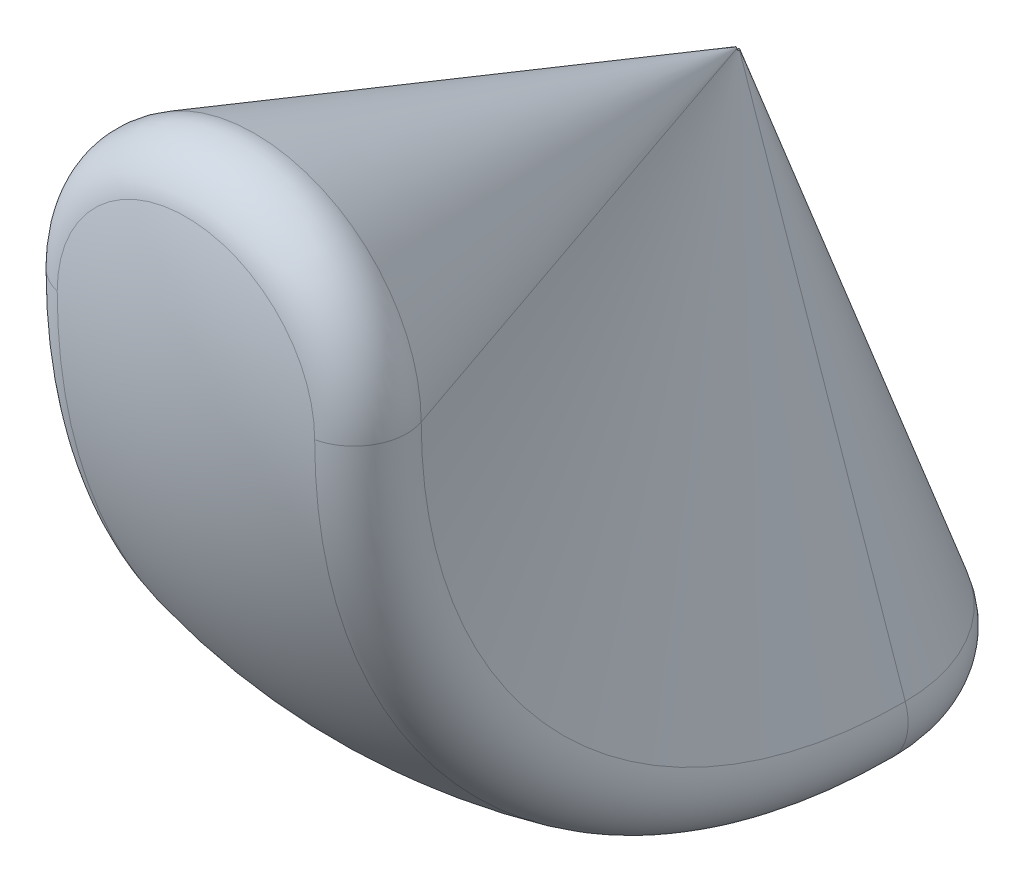
ISO-10303-21;
HEADER;
FILE_DESCRIPTION(('STEP AP214'),'2;1');
FILE_NAME('part.step','',(''),(''),'','','');
FILE_SCHEMA(('AUTOMOTIVE_DESIGN { 1 0 10303 214 1 1 1 1 }'));
ENDSEC;
DATA;
#1=APPLICATION_CONTEXT('core data for automotive mechanical design processes');
#2=APPLICATION_PROTOCOL_DEFINITION('international standard','automotive_design',2000,#1);
#3=PRODUCT_CONTEXT('',#1,'mechanical');
#4=PRODUCT('Part','Part','',(#3));
#5=PRODUCT_RELATED_PRODUCT_CATEGORY('part','',(#4));
#6=PRODUCT_DEFINITION_FORMATION('','',#4);
#7=PRODUCT_DEFINITION_CONTEXT('part definition',#1,'design');
#8=PRODUCT_DEFINITION('design','',#6,#7);
#9=PRODUCT_DEFINITION_SHAPE('','',#8);
#10=(LENGTH_UNIT() NAMED_UNIT(*) SI_UNIT(.MILLI.,.METRE.));
#11=(NAMED_UNIT(*) PLANE_ANGLE_UNIT() SI_UNIT($,.RADIAN.));
#12=(NAMED_UNIT(*) SI_UNIT($,.STERADIAN.) SOLID_ANGLE_UNIT());
#13=UNCERTAINTY_MEASURE_WITH_UNIT(LENGTH_MEASURE(1.E-05),#10,'distance_accuracy_value','');
#14=(GEOMETRIC_REPRESENTATION_CONTEXT(3) GLOBAL_UNCERTAINTY_ASSIGNED_CONTEXT((#13)) GLOBAL_UNIT_ASSIGNED_CONTEXT((#10,
#11,#12)) REPRESENTATION_CONTEXT('',''));
#15=CARTESIAN_POINT('',(0.,0.,0.));
#16=DIRECTION('',(0.,0.,1.));
#17=DIRECTION('',(1.,0.,0.));
#18=AXIS2_PLACEMENT_3D('',#15,#16,#17);
#19=CARTESIAN_POINT('',(1327.21859259555,0.,0.));
#20=DIRECTION('',(-1.,0.,0.));
#21=DIRECTION('',(0.,0.,1.));
#22=AXIS2_PLACEMENT_3D('',#19,#20,#21);
#23=TOROIDAL_SURFACE('',#22,5697.45476572379,600.000000000001);
#24=CARTESIAN_POINT('',(1463.3435764515,0.,0.));
#25=DIRECTION('',(-1.,0.,0.));
#26=DIRECTION('',(0.,0.,1.));
#27=AXIS2_PLACEMENT_3D('',#24,#25,#26);
#28=CIRCLE('',#27,6281.80910066982);
#29=CARTESIAN_POINT('',(1463.3435764515,-6281.80910066982,-2.19328319526542E-11));
#30=VERTEX_POINT('',#29);
#31=CARTESIAN_POINT('',(1463.3435764515,0.,6281.80910066982));
#32=VERTEX_POINT('',#31);
#33=EDGE_CURVE('E11',#30,#32,#28,.T.);
#34=ORIENTED_EDGE('',*,*,#33,.F.);
#35=CARTESIAN_POINT('',(1327.21859259555,-5697.45476572379,-1.98925685151979E-11));
#36=DIRECTION('',(0.,0.,1.));
#37=DIRECTION('',(0.,1.,0.));
#38=AXIS2_PLACEMENT_3D('',#35,#36,#37);
#39=CIRCLE('',#38,600.000000000001);
#40=CARTESIAN_POINT('',(1894.52973795514,-5502.11387304949,-1.92420065438025E-11));
#41=VERTEX_POINT('',#40);
#42=EDGE_CURVE('E46',#30,#41,#39,.T.);
#43=ORIENTED_EDGE('',*,*,#42,.T.);
#44=CARTESIAN_POINT('',(1894.52973795514,0.,0.));
#45=DIRECTION('',(-1.,0.,0.));
#46=DIRECTION('',(0.,0.,1.));
#47=AXIS2_PLACEMENT_3D('',#44,#45,#46);
#48=CIRCLE('',#47,5502.11387304949);
#49=CARTESIAN_POINT('',(1894.52973795514,0.,5502.11387304949));
#50=VERTEX_POINT('',#49);
#51=EDGE_CURVE('E111',#41,#50,#48,.T.);
#52=ORIENTED_EDGE('',*,*,#51,.T.);
#53=CARTESIAN_POINT('',(1327.21859259555,0.,5697.45476572379));
#54=DIRECTION('',(0.,1.,0.));
#55=DIRECTION('',(0.,0.,-1.));
#56=AXIS2_PLACEMENT_3D('',#53,#54,#55);
#57=CIRCLE('',#56,600.000000000001);
#58=EDGE_CURVE('E137',#32,#50,#57,.T.);
#59=ORIENTED_EDGE('',*,*,#58,.F.);
#60=EDGE_LOOP('',(#34,#43,#52,#59));
#61=FACE_BOUND('',#60,.T.);
#62=ADVANCED_FACE('F31',(#61),#23,.T.);
#63=CARTESIAN_POINT('',(0.,0.,0.));
#64=DIRECTION('',(-1.,0.,0.));
#65=DIRECTION('',(0.,-1.,0.));
#66=AXIS2_PLACEMENT_3D('',#63,#64,#65);
#67=SPHERICAL_SURFACE('',#66,6450.);
#68=CARTESIAN_POINT('',(-1463.34357645141,0.,0.));
#69=DIRECTION('',(-1.,0.,0.));
#70=DIRECTION('',(0.,0.,1.));
#71=AXIS2_PLACEMENT_3D('',#68,#69,#70);
#72=CIRCLE('',#71,6281.80910066984);
#73=CARTESIAN_POINT('',(-1463.3435764515,-6281.80910066982,-1.17502791670365E-11));
#74=VERTEX_POINT('',#73);
#75=CARTESIAN_POINT('',(-1463.34357645141,0.,6281.80910066984));
#76=VERTEX_POINT('',#75);
#77=EDGE_CURVE('E39',#74,#76,#72,.T.);
#78=ORIENTED_EDGE('',*,*,#77,.F.);
#79=CARTESIAN_POINT('',(0.,-6281.80910066982,-2.196875866457E-11));
#80=DIRECTION('',(0.,-1.,0.));
#81=DIRECTION('',(0.,0.,-1.));
#82=AXIS2_PLACEMENT_3D('',#79,#80,#81);
#83=CIRCLE('',#82,1463.3435764515);
#84=EDGE_CURVE('E100',#74,#30,#83,.T.);
#85=ORIENTED_EDGE('',*,*,#84,.T.);
#86=ORIENTED_EDGE('',*,*,#33,.T.);
#87=CARTESIAN_POINT('',(7.65242599136855E-13,-3.48710454993175E-13,6281.80910066984));
#88=DIRECTION('',(0.,0.,1.));
#89=DIRECTION('',(1.,0.,0.));
#90=AXIS2_PLACEMENT_3D('',#87,#88,#89);
#91=CIRCLE('',#90,1463.34357645141);
#92=EDGE_CURVE('E134',#32,#76,#91,.T.);
#93=ORIENTED_EDGE('',*,*,#92,.T.);
#94=EDGE_LOOP('',(#78,#85,#86,#93));
#95=FACE_BOUND('',#94,.T.);
#96=ADVANCED_FACE('F33',(#95),#67,.T.);
#97=CARTESIAN_POINT('',(-1327.21859259546,0.,0.));
#98=DIRECTION('',(-1.,0.,0.));
#99=DIRECTION('',(0.,0.,1.));
#100=AXIS2_PLACEMENT_3D('',#97,#98,#99);
#101=TOROIDAL_SURFACE('',#100,5697.45476572381,600.);
#102=CARTESIAN_POINT('',(-1894.52973795506,0.,0.));
#103=DIRECTION('',(-1.,0.,0.));
#104=DIRECTION('',(0.,0.,1.));
#105=AXIS2_PLACEMENT_3D('',#102,#103,#104);
#106=CIRCLE('',#105,5502.11387304952);
#107=CARTESIAN_POINT('',(-1894.52973795514,-5502.11387304949,-6.01256842940791E-12));
#108=VERTEX_POINT('',#107);
#109=CARTESIAN_POINT('',(-1894.52973795506,-3.05428675298453E-13,5502.11387304952));
#110=VERTEX_POINT('',#109);
#111=EDGE_CURVE('E125',#108,#110,#106,.T.);
#112=ORIENTED_EDGE('',*,*,#111,.F.);
#113=CARTESIAN_POINT('',(-1327.21859259546,-5697.45476572381,-1.9892568515198E-11));
#114=DIRECTION('',(0.,0.,1.));
#115=DIRECTION('',(0.,-1.,0.));
#116=AXIS2_PLACEMENT_3D('',#113,#114,#115);
#117=CIRCLE('',#116,600.);
#118=EDGE_CURVE('E120',#108,#74,#117,.T.);
#119=ORIENTED_EDGE('',*,*,#118,.T.);
#120=ORIENTED_EDGE('',*,*,#77,.T.);
#121=CARTESIAN_POINT('',(-1327.21859259546,0.,5697.45476572381));
#122=DIRECTION('',(0.,1.,0.));
#123=DIRECTION('',(0.,0.,1.));
#124=AXIS2_PLACEMENT_3D('',#121,#122,#123);
#125=CIRCLE('',#124,600.);
#126=EDGE_CURVE('E115',#110,#76,#125,.T.);
#127=ORIENTED_EDGE('',*,*,#126,.F.);
#128=EDGE_LOOP('',(#112,#119,#120,#127));
#129=FACE_BOUND('',#128,.T.);
#130=ADVANCED_FACE('F130',(#129),#101,.T.);
#131=CARTESIAN_POINT('',(-10.3298283986897,0.,0.));
#132=DIRECTION('',(-1.,0.,0.));
#133=DIRECTION('',(0.,0.,1.));
#134=AXIS2_PLACEMENT_3D('',#131,#132,#133);
#135=CONICAL_SURFACE('',#134,30.,1.23918376891598);
#136=CARTESIAN_POINT('',(-10.3298283986897,0.,0.));
#137=DIRECTION('',(-1.,0.,0.));
#138=DIRECTION('',(0.,0.,1.));
#139=AXIS2_PLACEMENT_3D('',#136,#137,#138);
#140=CIRCLE('',#139,30.);
#141=CARTESIAN_POINT('',(-10.3298283986902,-30.,0.));
#142=VERTEX_POINT('',#141);
#143=CARTESIAN_POINT('',(-10.3298283986897,0.,30.));
#144=VERTEX_POINT('',#143);
#145=EDGE_CURVE('E110',#142,#144,#140,.T.);
#146=ORIENTED_EDGE('',*,*,#145,.F.);
#147=DIRECTION('',(-0.325568154457151,-0.945518575599319,0.));
#148=VECTOR('',#147,1.);
#149=CARTESIAN_POINT('',(-10.3298283986897,-30.,-1.04744500833281E-13));
#150=LINE('',#149,#148);
#151=EDGE_CURVE('E89',#142,#108,#150,.T.);
#152=ORIENTED_EDGE('',*,*,#151,.T.);
#153=ORIENTED_EDGE('',*,*,#111,.T.);
#154=DIRECTION('',(-0.325568154457151,0.,0.945518575599319));
#155=VECTOR('',#154,1.);
#156=CARTESIAN_POINT('',(-10.3298283986897,0.,30.));
#157=LINE('',#156,#155);
#158=EDGE_CURVE('E145',#144,#110,#157,.T.);
#159=ORIENTED_EDGE('',*,*,#158,.F.);
#160=EDGE_LOOP('',(#146,#152,#153,#159));
#161=FACE_BOUND('',#160,.T.);
#162=ADVANCED_FACE('F162',(#161),#135,.F.);
#163=CARTESIAN_POINT('',(-2826.40974752601,0.,0.));
#164=DIRECTION('',(-1.,0.,0.));
#165=DIRECTION('',(0.,0.,1.));
#166=AXIS2_PLACEMENT_3D('',#163,#164,#165);
#167=CYLINDRICAL_SURFACE('',#166,30.);
#168=CARTESIAN_POINT('',(10.3298283986901,0.,0.));
#169=DIRECTION('',(-1.,0.,0.));
#170=DIRECTION('',(0.,0.,1.));
#171=AXIS2_PLACEMENT_3D('',#168,#169,#170);
#172=CIRCLE('',#171,30.);
#173=CARTESIAN_POINT('',(10.3298283986902,-30.,-1.04916075827077E-13));
#174=VERTEX_POINT('',#173);
#175=CARTESIAN_POINT('',(10.3298283986902,0.,30.));
#176=VERTEX_POINT('',#175);
#177=EDGE_CURVE('E103',#174,#176,#172,.T.);
#178=ORIENTED_EDGE('',*,*,#177,.F.);
#179=DIRECTION('',(-1.,0.,0.));
#180=VECTOR('',#179,1.);
#181=CARTESIAN_POINT('',(10.3298283986902,-30.,-1.04744500833281E-13));
#182=LINE('',#181,#180);
#183=EDGE_CURVE('E82',#174,#142,#182,.T.);
#184=ORIENTED_EDGE('',*,*,#183,.T.);
#185=ORIENTED_EDGE('',*,*,#145,.T.);
#186=DIRECTION('',(-1.,0.,0.));
#187=VECTOR('',#186,1.);
#188=CARTESIAN_POINT('',(10.3298283986902,0.,30.));
#189=LINE('',#188,#187);
#190=EDGE_CURVE('E106',#176,#144,#189,.T.);
#191=ORIENTED_EDGE('',*,*,#190,.F.);
#192=EDGE_LOOP('',(#178,#184,#185,#191));
#193=FACE_BOUND('',#192,.T.);
#194=ADVANCED_FACE('F104',(#193),#167,.F.);
#195=CARTESIAN_POINT('',(1894.52973795514,0.,0.));
#196=DIRECTION('',(1.,0.,0.));
#197=DIRECTION('',(0.,0.,-1.));
#198=AXIS2_PLACEMENT_3D('',#195,#196,#197);
#199=CONICAL_SURFACE('',#198,5502.11387304949,1.23918376891597);
#200=DIRECTION('',(-0.325568154457164,0.945518575599314,0.));
#201=VECTOR('',#200,1.);
#202=CARTESIAN_POINT('',(10.3298283986902,-30.,-1.04744500833281E-13));
#203=LINE('',#202,#201);
#204=EDGE_CURVE('E90',#41,#174,#203,.T.);
#205=ORIENTED_EDGE('',*,*,#204,.T.);
#206=ORIENTED_EDGE('',*,*,#177,.T.);
#207=DIRECTION('',(-0.325568154457164,0.,-0.945518575599314));
#208=VECTOR('',#207,1.);
#209=CARTESIAN_POINT('',(10.3298283986902,0.,30.));
#210=LINE('',#209,#208);
#211=EDGE_CURVE('E149',#50,#176,#210,.T.);
#212=ORIENTED_EDGE('',*,*,#211,.F.);
#213=ORIENTED_EDGE('',*,*,#51,.F.);
#214=EDGE_LOOP('',(#205,#206,#212,#213));
#215=FACE_BOUND('',#214,.T.);
#216=ADVANCED_FACE('F113',(#215),#199,.F.);
#217=CARTESIAN_POINT('',(6.66133814775094E-13,-3.16272273133346E-13,5697.45476572381));
#218=DIRECTION('',(0.,0.,1.));
#219=DIRECTION('',(1.,0.,0.));
#220=AXIS2_PLACEMENT_3D('',#217,#218,#219);
#221=TOROIDAL_SURFACE('',#220,1327.21859259547,600.);
#222=ORIENTED_EDGE('',*,*,#92,.F.);
#223=ORIENTED_EDGE('',*,*,#58,.T.);
#224=CARTESIAN_POINT('',(6.69805263653459E-13,-3.05428675298453E-13,5502.11387304952));
#225=DIRECTION('',(0.,0.,1.));
#226=DIRECTION('',(1.,0.,0.));
#227=AXIS2_PLACEMENT_3D('',#224,#225,#226);
#228=CIRCLE('',#227,1894.52973795506);
#229=EDGE_CURVE('E143',#50,#110,#228,.T.);
#230=ORIENTED_EDGE('',*,*,#229,.T.);
#231=ORIENTED_EDGE('',*,*,#126,.T.);
#232=EDGE_LOOP('',(#222,#223,#230,#231));
#233=FACE_BOUND('',#232,.T.);
#234=ADVANCED_FACE('F141',(#233),#221,.T.);
#235=CARTESIAN_POINT('',(10.3298283986897,0.,30.));
#236=DIRECTION('',(0.,0.,1.));
#237=DIRECTION('',(1.,0.,0.));
#238=AXIS2_PLACEMENT_3D('',#235,#236,#237);
#239=PLANE('',#238);
#240=CARTESIAN_POINT('',(0.,0.,30.));
#241=DIRECTION('',(0.,0.,1.));
#242=DIRECTION('',(1.,0.,0.));
#243=AXIS2_PLACEMENT_3D('',#240,#241,#242);
#244=CIRCLE('',#243,10.3298283986897);
#245=EDGE_CURVE('E138',#176,#144,#244,.T.);
#246=ORIENTED_EDGE('',*,*,#245,.F.);
#247=ORIENTED_EDGE('',*,*,#190,.T.);
#248=EDGE_LOOP('',(#246,#247));
#249=FACE_BOUND('',#248,.T.);
#250=ADVANCED_FACE('F164',(#249),#239,.F.);
#251=CARTESIAN_POINT('',(0.,0.,30.));
#252=DIRECTION('',(0.,0.,1.));
#253=DIRECTION('',(1.,0.,0.));
#254=AXIS2_PLACEMENT_3D('',#251,#252,#253);
#255=CONICAL_SURFACE('',#254,10.3298283986897,0.331612557878916);
#256=ORIENTED_EDGE('',*,*,#211,.T.);
#257=ORIENTED_EDGE('',*,*,#245,.T.);
#258=ORIENTED_EDGE('',*,*,#158,.T.);
#259=ORIENTED_EDGE('',*,*,#229,.F.);
#260=EDGE_LOOP('',(#256,#257,#258,#259));
#261=FACE_BOUND('',#260,.T.);
#262=ADVANCED_FACE('F159',(#261),#255,.T.);
#263=CARTESIAN_POINT('',(0.,-5697.45476572379,-1.99251532074006E-11));
#264=DIRECTION('',(0.,-1.,0.));
#265=DIRECTION('',(0.,0.,-1.));
#266=AXIS2_PLACEMENT_3D('',#263,#264,#265);
#267=TOROIDAL_SURFACE('',#266,1327.21859259555,600.000000000001);
#268=CARTESIAN_POINT('',(0.,-5502.11387304949,-1.92420065438025E-11));
#269=DIRECTION('',(0.,-1.,0.));
#270=DIRECTION('',(0.,0.,-1.));
#271=AXIS2_PLACEMENT_3D('',#268,#269,#270);
#272=CIRCLE('',#271,1894.52973795514);
#273=EDGE_CURVE('E99',#108,#41,#272,.T.);
#274=ORIENTED_EDGE('',*,*,#273,.T.);
#275=ORIENTED_EDGE('',*,*,#42,.F.);
#276=ORIENTED_EDGE('',*,*,#84,.F.);
#277=ORIENTED_EDGE('',*,*,#118,.F.);
#278=EDGE_LOOP('',(#274,#275,#276,#277));
#279=FACE_BOUND('',#278,.T.);
#280=ADVANCED_FACE('F171',(#279),#267,.T.);
#281=CARTESIAN_POINT('',(0.,-30.,-1.04916075827077E-13));
#282=DIRECTION('',(0.,-1.,0.));
#283=DIRECTION('',(0.,0.,-1.));
#284=AXIS2_PLACEMENT_3D('',#281,#282,#283);
#285=CONICAL_SURFACE('',#284,10.3298283986902,0.331612557878931);
#286=CARTESIAN_POINT('',(0.,-30.,-1.04916075827077E-13));
#287=DIRECTION('',(0.,-1.,0.));
#288=DIRECTION('',(0.,0.,-1.));
#289=AXIS2_PLACEMENT_3D('',#286,#287,#288);
#290=CIRCLE('',#289,10.3298283986902);
#291=EDGE_CURVE('E85',#142,#174,#290,.T.);
#292=ORIENTED_EDGE('',*,*,#291,.T.);
#293=ORIENTED_EDGE('',*,*,#204,.F.);
#294=ORIENTED_EDGE('',*,*,#273,.F.);
#295=ORIENTED_EDGE('',*,*,#151,.F.);
#296=EDGE_LOOP('',(#292,#293,#294,#295));
#297=FACE_BOUND('',#296,.T.);
#298=ADVANCED_FACE('F94',(#297),#285,.T.);
#299=CARTESIAN_POINT('',(-10.3298283986902,-30.,0.));
#300=DIRECTION('',(0.,-1.,0.));
#301=DIRECTION('',(0.,0.,-1.));
#302=AXIS2_PLACEMENT_3D('',#299,#300,#301);
#303=PLANE('',#302);
#304=ORIENTED_EDGE('',*,*,#183,.F.);
#305=ORIENTED_EDGE('',*,*,#291,.F.);
#306=EDGE_LOOP('',(#304,#305));
#307=FACE_BOUND('',#306,.T.);
#308=ADVANCED_FACE('F84',(#307),#303,.F.);
#309=CLOSED_SHELL('',(#62,#96,#130,#162,#194,#216,#234,#250,#262,#280,#298,#308));
#310=MANIFOLD_SOLID_BREP('B2',#309);
#311=ADVANCED_BREP_SHAPE_REPRESENTATION('',(#18,#310),#14);
#312=SHAPE_DEFINITION_REPRESENTATION(#9,#311);
ENDSEC;
END-ISO-10303-21;
